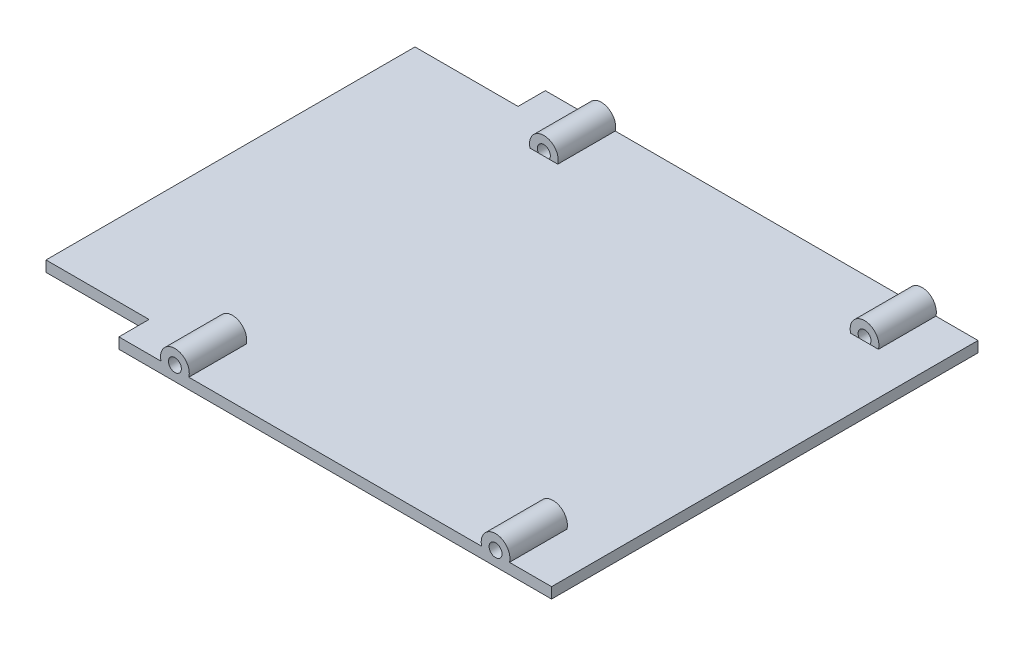
ISO-10303-21;
HEADER;
FILE_DESCRIPTION(('STEP AP214'),'2;1');
FILE_NAME('part.step','',(''),(''),'','','');
FILE_SCHEMA(('AUTOMOTIVE_DESIGN { 1 0 10303 214 1 1 1 1 }'));
ENDSEC;
DATA;
#1=APPLICATION_CONTEXT('core data for automotive mechanical design processes');
#2=APPLICATION_PROTOCOL_DEFINITION('international standard','automotive_design',2000,#1);
#3=PRODUCT_CONTEXT('',#1,'mechanical');
#4=PRODUCT('Part','Part','',(#3));
#5=PRODUCT_RELATED_PRODUCT_CATEGORY('part','',(#4));
#6=PRODUCT_DEFINITION_FORMATION('','',#4);
#7=PRODUCT_DEFINITION_CONTEXT('part definition',#1,'design');
#8=PRODUCT_DEFINITION('design','',#6,#7);
#9=PRODUCT_DEFINITION_SHAPE('','',#8);
#10=(LENGTH_UNIT() NAMED_UNIT(*) SI_UNIT(.MILLI.,.METRE.));
#11=(NAMED_UNIT(*) PLANE_ANGLE_UNIT() SI_UNIT($,.RADIAN.));
#12=(NAMED_UNIT(*) SI_UNIT($,.STERADIAN.) SOLID_ANGLE_UNIT());
#13=UNCERTAINTY_MEASURE_WITH_UNIT(LENGTH_MEASURE(1.E-05),#10,'distance_accuracy_value','');
#14=(GEOMETRIC_REPRESENTATION_CONTEXT(3) GLOBAL_UNCERTAINTY_ASSIGNED_CONTEXT((#13)) GLOBAL_UNIT_ASSIGNED_CONTEXT((#10,
#11,#12)) REPRESENTATION_CONTEXT('',''));
#15=CARTESIAN_POINT('',(0.,0.,0.));
#16=DIRECTION('',(0.,0.,1.));
#17=DIRECTION('',(1.,0.,0.));
#18=AXIS2_PLACEMENT_3D('',#15,#16,#17);
#19=CARTESIAN_POINT('',(-536.173043629544,-6.26719487503217,135.104672809914));
#20=DIRECTION('',(1.,0.,0.));
#21=DIRECTION('',(0.,0.,1.));
#22=AXIS2_PLACEMENT_3D('',#19,#20,#21);
#23=PLANE('',#22);
#24=DIRECTION('',(0.,1.,0.));
#25=VECTOR('',#24,1.);
#26=CARTESIAN_POINT('',(-536.173043629546,-26.2671948750322,19.2560035032262));
#27=LINE('',#26,#25);
#28=CARTESIAN_POINT('',(-536.173043629544,-26.2671948750323,19.2560035032263));
#29=VERTEX_POINT('',#28);
#30=CARTESIAN_POINT('',(-536.173043629544,-24.7671948750323,19.2560035032263));
#31=VERTEX_POINT('',#30);
#32=EDGE_CURVE('E573',#29,#31,#27,.T.);
#33=ORIENTED_EDGE('',*,*,#32,.T.);
#34=DIRECTION('',(0.,0.,-1.));
#35=VECTOR('',#34,1.);
#36=CARTESIAN_POINT('',(-536.173043629544,-24.7671948750323,135.104672809914));
#37=LINE('',#36,#35);
#38=CARTESIAN_POINT('',(-536.173043629544,-24.7671948750323,15.4560035032414));
#39=VERTEX_POINT('',#38);
#40=EDGE_CURVE('E521',#31,#39,#37,.T.);
#41=ORIENTED_EDGE('',*,*,#40,.T.);
#42=DIRECTION('',(0.,1.,0.));
#43=VECTOR('',#42,1.);
#44=CARTESIAN_POINT('',(-536.173043629544,-6.26719487503217,15.4560035032414));
#45=LINE('',#44,#43);
#46=CARTESIAN_POINT('',(-536.173043629544,-26.2671948750323,15.4560035032414));
#47=VERTEX_POINT('',#46);
#48=EDGE_CURVE('E539',#47,#39,#45,.T.);
#49=ORIENTED_EDGE('',*,*,#48,.F.);
#50=DIRECTION('',(0.,0.,-1.));
#51=VECTOR('',#50,1.);
#52=CARTESIAN_POINT('',(-536.173043629544,-26.2671948750323,135.104672809914));
#53=LINE('',#52,#51);
#54=EDGE_CURVE('E540',#29,#47,#53,.T.);
#55=ORIENTED_EDGE('',*,*,#54,.F.);
#56=EDGE_LOOP('',(#33,#41,#49,#55));
#57=FACE_BOUND('',#56,.T.);
#58=ADVANCED_FACE('F41',(#57),#23,.F.);
#59=DIRECTION('',(0.,-1.,0.));
#60=VECTOR('',#59,1.);
#61=CARTESIAN_POINT('',(-536.173043629546,-24.7671948750323,70.6360035032162));
#62=LINE('',#61,#60);
#63=CARTESIAN_POINT('',(-536.173043629544,-24.7671948750323,70.6360035032162));
#64=VERTEX_POINT('',#63);
#65=CARTESIAN_POINT('',(-536.173043629546,-26.2671948750323,70.6360035032162));
#66=VERTEX_POINT('',#65);
#67=EDGE_CURVE('E577',#64,#66,#62,.T.);
#68=ORIENTED_EDGE('',*,*,#67,.T.);
#69=CARTESIAN_POINT('',(-536.173043629544,-26.2671948750323,74.8360035032172));
#70=VERTEX_POINT('',#69);
#71=EDGE_CURVE('E537',#70,#66,#53,.T.);
#72=ORIENTED_EDGE('',*,*,#71,.F.);
#73=DIRECTION('',(0.,1.,0.));
#74=VECTOR('',#73,1.);
#75=CARTESIAN_POINT('',(-536.173043629544,-6.26719487503217,74.8360035032172));
#76=LINE('',#75,#74);
#77=CARTESIAN_POINT('',(-536.173043629544,-24.7671948750323,74.8360035032172));
#78=VERTEX_POINT('',#77);
#79=EDGE_CURVE('E532',#70,#78,#76,.T.);
#80=ORIENTED_EDGE('',*,*,#79,.T.);
#81=EDGE_CURVE('E517',#78,#64,#37,.T.);
#82=ORIENTED_EDGE('',*,*,#81,.T.);
#83=EDGE_LOOP('',(#68,#72,#80,#82));
#84=FACE_BOUND('',#83,.T.);
#85=ADVANCED_FACE('F256',(#84),#23,.F.);
#86=CARTESIAN_POINT('',(-360.373043629546,-24.7671948750323,135.104672809914));
#87=DIRECTION('',(0.,-1.,0.));
#88=DIRECTION('',(0.,0.,1.));
#89=AXIS2_PLACEMENT_3D('',#86,#87,#88);
#90=PLANE('',#89);
#91=DIRECTION('',(-1.,0.,0.));
#92=VECTOR('',#91,1.);
#93=CARTESIAN_POINT('',(-360.373043629546,-24.7671948750323,23.4560035032414));
#94=LINE('',#93,#92);
#95=CARTESIAN_POINT('',(-526.43655195634,-24.7671948750323,23.4560035032414));
#96=VERTEX_POINT('',#95);
#97=CARTESIAN_POINT('',(-527.624712152125,-24.7671948750322,23.4560035032414));
#98=VERTEX_POINT('',#97);
#99=EDGE_CURVE('E185',#96,#98,#94,.T.);
#100=ORIENTED_EDGE('',*,*,#99,.T.);
#101=CARTESIAN_POINT('',(-529.121375106838,-24.7671948750323,23.4560035032414));
#102=VERTEX_POINT('',#101);
#103=EDGE_CURVE('E190',#98,#102,#94,.T.);
#104=ORIENTED_EDGE('',*,*,#103,.T.);
#105=CARTESIAN_POINT('',(-530.309535302623,-24.7671948750323,23.4560035032414));
#106=VERTEX_POINT('',#105);
#107=EDGE_CURVE('E187',#102,#106,#94,.T.);
#108=ORIENTED_EDGE('',*,*,#107,.T.);
#109=DIRECTION('',(0.,0.,-1.));
#110=VECTOR('',#109,1.);
#111=CARTESIAN_POINT('',(-530.309535302623,-24.7671948750323,23.4560035032414));
#112=LINE('',#111,#110);
#113=CARTESIAN_POINT('',(-530.309535302623,-24.7671948750323,15.4560035032414));
#114=VERTEX_POINT('',#113);
#115=EDGE_CURVE('E216',#114,#106,#112,.F.);
#116=ORIENTED_EDGE('',*,*,#115,.F.);
#117=DIRECTION('',(1.,0.,0.));
#118=VECTOR('',#117,1.);
#119=CARTESIAN_POINT('',(-360.373043629546,-24.7671948750323,15.4560035032414));
#120=LINE('',#119,#118);
#121=EDGE_CURVE('E519',#39,#114,#120,.T.);
#122=ORIENTED_EDGE('',*,*,#121,.F.);
#123=ORIENTED_EDGE('',*,*,#40,.F.);
#124=DIRECTION('',(1.,0.,0.));
#125=VECTOR('',#124,1.);
#126=CARTESIAN_POINT('',(-602.124934645333,-24.7671948750274,19.2560035032262));
#127=LINE('',#126,#125);
#128=CARTESIAN_POINT('',(-550.523043629545,-24.7671948750274,19.2560035032262));
#129=VERTEX_POINT('',#128);
#130=EDGE_CURVE('E571',#129,#31,#127,.T.);
#131=ORIENTED_EDGE('',*,*,#130,.F.);
#132=DIRECTION('',(0.,0.,1.));
#133=VECTOR('',#132,1.);
#134=CARTESIAN_POINT('',(-550.523043629545,-24.7671948750312,19.2560035032262));
#135=LINE('',#134,#133);
#136=CARTESIAN_POINT('',(-550.523043629545,-24.7671948750312,70.6360035032162));
#137=VERTEX_POINT('',#136);
#138=EDGE_CURVE('E587',#129,#137,#135,.T.);
#139=ORIENTED_EDGE('',*,*,#138,.T.);
#140=DIRECTION('',(1.,0.,0.));
#141=VECTOR('',#140,1.);
#142=CARTESIAN_POINT('',(-602.124934645333,-24.7671948750274,70.6360035032162));
#143=LINE('',#142,#141);
#144=EDGE_CURVE('E581',#137,#64,#143,.T.);
#145=ORIENTED_EDGE('',*,*,#144,.T.);
#146=ORIENTED_EDGE('',*,*,#81,.F.);
#147=DIRECTION('',(1.,0.,0.));
#148=VECTOR('',#147,1.);
#149=CARTESIAN_POINT('',(-360.373043629546,-24.7671948750323,74.8360035032172));
#150=LINE('',#149,#148);
#151=CARTESIAN_POINT('',(-530.309535302028,-24.7671948750323,74.8360035032172));
#152=VERTEX_POINT('',#151);
#153=EDGE_CURVE('E618',#78,#152,#150,.T.);
#154=ORIENTED_EDGE('',*,*,#153,.T.);
#155=DIRECTION('',(0.,0.,1.));
#156=VECTOR('',#155,1.);
#157=CARTESIAN_POINT('',(-530.309535302028,-24.7671948750323,66.8360035032172));
#158=LINE('',#157,#156);
#159=CARTESIAN_POINT('',(-530.309535302028,-24.7671948750323,66.8360035032172));
#160=VERTEX_POINT('',#159);
#161=EDGE_CURVE('E559',#160,#152,#158,.T.);
#162=ORIENTED_EDGE('',*,*,#161,.F.);
#163=DIRECTION('',(1.,0.,0.));
#164=VECTOR('',#163,1.);
#165=CARTESIAN_POINT('',(-360.373043629546,-24.7671948750323,66.8360035032172));
#166=LINE('',#165,#164);
#167=CARTESIAN_POINT('',(-529.121375106838,-24.7671948750323,66.8360035032172));
#168=VERTEX_POINT('',#167);
#169=EDGE_CURVE('E568',#160,#168,#166,.T.);
#170=ORIENTED_EDGE('',*,*,#169,.T.);
#171=CARTESIAN_POINT('',(-527.624712152128,-24.7671948750323,66.8360035032172));
#172=VERTEX_POINT('',#171);
#173=EDGE_CURVE('E572',#168,#172,#166,.T.);
#174=ORIENTED_EDGE('',*,*,#173,.T.);
#175=CARTESIAN_POINT('',(-526.436551956938,-24.7671948750323,66.8360035032172));
#176=VERTEX_POINT('',#175);
#177=EDGE_CURVE('E564',#172,#176,#166,.T.);
#178=ORIENTED_EDGE('',*,*,#177,.T.);
#179=DIRECTION('',(0.,0.,1.));
#180=VECTOR('',#179,1.);
#181=CARTESIAN_POINT('',(-526.436551956938,-24.7671948750323,66.8360035032172));
#182=LINE('',#181,#180);
#183=CARTESIAN_POINT('',(-526.436551956938,-24.7671948750323,74.8360035032172));
#184=VERTEX_POINT('',#183);
#185=EDGE_CURVE('E632',#184,#176,#182,.F.);
#186=ORIENTED_EDGE('',*,*,#185,.F.);
#187=CARTESIAN_POINT('',(-485.659535303219,-24.7671948750323,74.8360035032172));
#188=VERTEX_POINT('',#187);
#189=EDGE_CURVE('E617',#184,#188,#150,.T.);
#190=ORIENTED_EDGE('',*,*,#189,.T.);
#191=DIRECTION('',(0.,0.,1.));
#192=VECTOR('',#191,1.);
#193=CARTESIAN_POINT('',(-485.659535303219,-24.7671948750323,66.8360035032172));
#194=LINE('',#193,#192);
#195=CARTESIAN_POINT('',(-485.659535303219,-24.7671948750323,66.8360035032172));
#196=VERTEX_POINT('',#195);
#197=EDGE_CURVE('E629',#196,#188,#194,.T.);
#198=ORIENTED_EDGE('',*,*,#197,.F.);
#199=DIRECTION('',(1.,0.,0.));
#200=VECTOR('',#199,1.);
#201=CARTESIAN_POINT('',(-360.373043629546,-24.7671948750323,66.8360035032172));
#202=LINE('',#201,#200);
#203=CARTESIAN_POINT('',(-484.471375106822,-24.7671948750323,66.8360035032172));
#204=VERTEX_POINT('',#203);
#205=EDGE_CURVE('E561',#196,#204,#202,.T.);
#206=ORIENTED_EDGE('',*,*,#205,.T.);
#207=CARTESIAN_POINT('',(-482.974712152113,-24.7671948750323,66.8360035032172));
#208=VERTEX_POINT('',#207);
#209=EDGE_CURVE('E558',#204,#208,#202,.T.);
#210=ORIENTED_EDGE('',*,*,#209,.T.);
#211=CARTESIAN_POINT('',(-481.786551955716,-24.7671948750323,66.8360035032172));
#212=VERTEX_POINT('',#211);
#213=EDGE_CURVE('E553',#208,#212,#202,.T.);
#214=ORIENTED_EDGE('',*,*,#213,.T.);
#215=DIRECTION('',(0.,0.,1.));
#216=VECTOR('',#215,1.);
#217=CARTESIAN_POINT('',(-481.786551955716,-24.7671948750323,66.8360035032172));
#218=LINE('',#217,#216);
#219=CARTESIAN_POINT('',(-481.786551955716,-24.7671948750323,74.8360035032172));
#220=VERTEX_POINT('',#219);
#221=EDGE_CURVE('E628',#220,#212,#218,.F.);
#222=ORIENTED_EDGE('',*,*,#221,.F.);
#223=CARTESIAN_POINT('',(-475.923043629544,-24.7671948750323,74.8360035032172));
#224=VERTEX_POINT('',#223);
#225=EDGE_CURVE('E616',#220,#224,#150,.T.);
#226=ORIENTED_EDGE('',*,*,#225,.T.);
#227=DIRECTION('',(0.,0.,-1.));
#228=VECTOR('',#227,1.);
#229=CARTESIAN_POINT('',(-475.923043629544,-24.7671948750323,135.104672809914));
#230=LINE('',#229,#228);
#231=CARTESIAN_POINT('',(-475.923043629544,-24.7671948750323,15.4560035032414));
#232=VERTEX_POINT('',#231);
#233=EDGE_CURVE('E513',#224,#232,#230,.T.);
#234=ORIENTED_EDGE('',*,*,#233,.T.);
#235=CARTESIAN_POINT('',(-481.786551956575,-24.7671948750323,15.4560035032414));
#236=VERTEX_POINT('',#235);
#237=EDGE_CURVE('E510',#236,#232,#120,.T.);
#238=ORIENTED_EDGE('',*,*,#237,.F.);
#239=DIRECTION('',(0.,0.,-1.));
#240=VECTOR('',#239,1.);
#241=CARTESIAN_POINT('',(-481.786551956575,-24.7671948750323,23.4560035032414));
#242=LINE('',#241,#240);
#243=CARTESIAN_POINT('',(-481.786551956575,-24.7671948750323,23.4560035032414));
#244=VERTEX_POINT('',#243);
#245=EDGE_CURVE('E219',#244,#236,#242,.T.);
#246=ORIENTED_EDGE('',*,*,#245,.F.);
#247=DIRECTION('',(-1.,0.,0.));
#248=VECTOR('',#247,1.);
#249=CARTESIAN_POINT('',(-360.373043629546,-24.7671948750323,23.4560035032414));
#250=LINE('',#249,#248);
#251=CARTESIAN_POINT('',(-482.974712152109,-24.7671948750323,23.4560035032414));
#252=VERTEX_POINT('',#251);
#253=EDGE_CURVE('E204',#244,#252,#250,.T.);
#254=ORIENTED_EDGE('',*,*,#253,.T.);
#255=CARTESIAN_POINT('',(-484.471375106822,-24.7671948750323,23.4560035032414));
#256=VERTEX_POINT('',#255);
#257=EDGE_CURVE('E207',#252,#256,#250,.T.);
#258=ORIENTED_EDGE('',*,*,#257,.T.);
#259=CARTESIAN_POINT('',(-485.659535302359,-24.7671948750323,23.4560035032414));
#260=VERTEX_POINT('',#259);
#261=EDGE_CURVE('E208',#256,#260,#250,.T.);
#262=ORIENTED_EDGE('',*,*,#261,.T.);
#263=DIRECTION('',(0.,0.,-1.));
#264=VECTOR('',#263,1.);
#265=CARTESIAN_POINT('',(-485.659535302359,-24.7671948750323,23.4560035032414));
#266=LINE('',#265,#264);
#267=CARTESIAN_POINT('',(-485.659535302359,-24.7671948750323,15.4560035032414));
#268=VERTEX_POINT('',#267);
#269=EDGE_CURVE('E224',#268,#260,#266,.F.);
#270=ORIENTED_EDGE('',*,*,#269,.F.);
#271=CARTESIAN_POINT('',(-526.43655195634,-24.7671948750322,15.4560035032414));
#272=VERTEX_POINT('',#271);
#273=EDGE_CURVE('E516',#272,#268,#120,.T.);
#274=ORIENTED_EDGE('',*,*,#273,.F.);
#275=DIRECTION('',(0.,0.,-1.));
#276=VECTOR('',#275,1.);
#277=CARTESIAN_POINT('',(-526.43655195634,-24.7671948750323,23.4560035032414));
#278=LINE('',#277,#276);
#279=EDGE_CURVE('E198',#96,#272,#278,.T.);
#280=ORIENTED_EDGE('',*,*,#279,.F.);
#281=EDGE_LOOP('',(#100,#104,#108,#116,#122,#123,#131,#139,#145,#146,#154,#162,#170,#174,#178,
#186,#190,#198,#206,#210,#214,#222,#226,#234,#238,#246,#254,#258,#262,#270,#274,#280));
#282=FACE_BOUND('',#281,.T.);
#283=ADVANCED_FACE('F195',(#282),#90,.F.);
#284=CARTESIAN_POINT('',(-475.923043629544,-6.26719487503217,135.104672809914));
#285=DIRECTION('',(-1.,0.,0.));
#286=DIRECTION('',(0.,0.,-1.));
#287=AXIS2_PLACEMENT_3D('',#284,#285,#286);
#288=PLANE('',#287);
#289=DIRECTION('',(0.,-1.,0.));
#290=VECTOR('',#289,1.);
#291=CARTESIAN_POINT('',(-475.923043629544,-6.26719487503217,74.8360035032172));
#292=LINE('',#291,#290);
#293=CARTESIAN_POINT('',(-475.923043629544,-26.2671948750323,74.8360035032172));
#294=VERTEX_POINT('',#293);
#295=EDGE_CURVE('E622',#224,#294,#292,.T.);
#296=ORIENTED_EDGE('',*,*,#295,.T.);
#297=DIRECTION('',(0.,0.,-1.));
#298=VECTOR('',#297,1.);
#299=CARTESIAN_POINT('',(-475.923043629544,-26.2671948750323,135.104672809914));
#300=LINE('',#299,#298);
#301=CARTESIAN_POINT('',(-475.923043629544,-26.2671948750323,15.4560035032414));
#302=VERTEX_POINT('',#301);
#303=EDGE_CURVE('E529',#294,#302,#300,.T.);
#304=ORIENTED_EDGE('',*,*,#303,.T.);
#305=DIRECTION('',(0.,-1.,0.));
#306=VECTOR('',#305,1.);
#307=CARTESIAN_POINT('',(-475.923043629544,-6.26719487503217,15.4560035032414));
#308=LINE('',#307,#306);
#309=EDGE_CURVE('E527',#232,#302,#308,.T.);
#310=ORIENTED_EDGE('',*,*,#309,.F.);
#311=ORIENTED_EDGE('',*,*,#233,.F.);
#312=EDGE_LOOP('',(#296,#304,#310,#311));
#313=FACE_BOUND('',#312,.T.);
#314=ADVANCED_FACE('F271',(#313),#288,.F.);
#315=CARTESIAN_POINT('',(-360.373043629546,-26.2671948750322,135.104672809914));
#316=DIRECTION('',(0.,1.,0.));
#317=DIRECTION('',(-1.,0.,0.));
#318=AXIS2_PLACEMENT_3D('',#315,#316,#317);
#319=PLANE('',#318);
#320=DIRECTION('',(-1.,0.,0.));
#321=VECTOR('',#320,1.);
#322=CARTESIAN_POINT('',(-360.373043629546,-26.2671948750322,15.4560035032414));
#323=LINE('',#322,#321);
#324=EDGE_CURVE('E536',#302,#47,#323,.T.);
#325=ORIENTED_EDGE('',*,*,#324,.F.);
#326=ORIENTED_EDGE('',*,*,#303,.F.);
#327=DIRECTION('',(-1.,0.,0.));
#328=VECTOR('',#327,1.);
#329=CARTESIAN_POINT('',(-360.373043629546,-26.2671948750322,74.8360035032172));
#330=LINE('',#329,#328);
#331=EDGE_CURVE('E545',#294,#70,#330,.T.);
#332=ORIENTED_EDGE('',*,*,#331,.T.);
#333=ORIENTED_EDGE('',*,*,#71,.T.);
#334=DIRECTION('',(1.,0.,0.));
#335=VECTOR('',#334,1.);
#336=CARTESIAN_POINT('',(-602.124934645333,-26.2671948750274,70.6360035032162));
#337=LINE('',#336,#335);
#338=CARTESIAN_POINT('',(-550.523043629545,-26.2671948750312,70.6360035032162));
#339=VERTEX_POINT('',#338);
#340=EDGE_CURVE('E580',#339,#66,#337,.T.);
#341=ORIENTED_EDGE('',*,*,#340,.F.);
#342=DIRECTION('',(0.,0.,-1.));
#343=VECTOR('',#342,1.);
#344=CARTESIAN_POINT('',(-550.523043629545,-26.2671948750312,70.6360035032162));
#345=LINE('',#344,#343);
#346=CARTESIAN_POINT('',(-550.523043629545,-26.2671948750312,19.2560035032262));
#347=VERTEX_POINT('',#346);
#348=EDGE_CURVE('E582',#339,#347,#345,.T.);
#349=ORIENTED_EDGE('',*,*,#348,.T.);
#350=DIRECTION('',(1.,0.,0.));
#351=VECTOR('',#350,1.);
#352=CARTESIAN_POINT('',(-602.124934645333,-26.2671948750274,19.2560035032262));
#353=LINE('',#352,#351);
#354=EDGE_CURVE('E576',#347,#29,#353,.T.);
#355=ORIENTED_EDGE('',*,*,#354,.T.);
#356=ORIENTED_EDGE('',*,*,#54,.T.);
#357=EDGE_LOOP('',(#325,#326,#332,#333,#341,#349,#355,#356));
#358=FACE_BOUND('',#357,.T.);
#359=ADVANCED_FACE('F268',(#358),#319,.F.);
#360=CARTESIAN_POINT('',(0.,0.,15.4560035032414));
#361=DIRECTION('',(0.,0.,1.));
#362=DIRECTION('',(0.,1.,0.));
#363=AXIS2_PLACEMENT_3D('',#360,#361,#362);
#364=PLANE('',#363);
#365=CARTESIAN_POINT('',(-483.723043629466,-24.267194875035,15.4560035032414));
#366=DIRECTION('',(0.,0.,1.));
#367=DIRECTION('',(1.,0.,0.));
#368=AXIS2_PLACEMENT_3D('',#365,#366,#367);
#369=CIRCLE('',#368,0.900000000000005);
#370=CARTESIAN_POINT('',(-482.823043629466,-24.267194875035,15.4560035032414));
#371=VERTEX_POINT('',#370);
#372=EDGE_CURVE('E237',#371,#371,#369,.T.);
#373=ORIENTED_EDGE('',*,*,#372,.T.);
#374=EDGE_LOOP('',(#373));
#375=FACE_BOUND('',#374,.T.);
#376=CARTESIAN_POINT('',(-528.373043629481,-24.267194875035,15.4560035032414));
#377=DIRECTION('',(0.,0.,1.));
#378=DIRECTION('',(1.,0.,0.));
#379=AXIS2_PLACEMENT_3D('',#376,#377,#378);
#380=CIRCLE('',#379,0.900000000000005);
#381=CARTESIAN_POINT('',(-527.473043629481,-24.267194875035,15.4560035032414));
#382=VERTEX_POINT('',#381);
#383=EDGE_CURVE('E179',#382,#382,#380,.T.);
#384=ORIENTED_EDGE('',*,*,#383,.T.);
#385=EDGE_LOOP('',(#384));
#386=FACE_BOUND('',#385,.T.);
#387=ORIENTED_EDGE('',*,*,#48,.T.);
#388=ORIENTED_EDGE('',*,*,#121,.T.);
#389=CARTESIAN_POINT('',(-528.373043629481,-24.267194875035,15.4560035032414));
#390=DIRECTION('',(0.,0.,1.));
#391=DIRECTION('',(1.,0.,0.));
#392=AXIS2_PLACEMENT_3D('',#389,#390,#391);
#393=CIRCLE('',#392,2.00000000003575);
#394=EDGE_CURVE('E232',#272,#114,#393,.T.);
#395=ORIENTED_EDGE('',*,*,#394,.F.);
#396=ORIENTED_EDGE('',*,*,#273,.T.);
#397=CARTESIAN_POINT('',(-483.723043629467,-24.2671948750323,15.4560035032414));
#398=DIRECTION('',(0.,0.,1.));
#399=DIRECTION('',(1.,0.,0.));
#400=AXIS2_PLACEMENT_3D('',#397,#398,#399);
#401=CIRCLE('',#400,1.99999999979497);
#402=EDGE_CURVE('E230',#236,#268,#401,.T.);
#403=ORIENTED_EDGE('',*,*,#402,.F.);
#404=ORIENTED_EDGE('',*,*,#237,.T.);
#405=ORIENTED_EDGE('',*,*,#309,.T.);
#406=ORIENTED_EDGE('',*,*,#324,.T.);
#407=EDGE_LOOP('',(#387,#388,#395,#396,#403,#404,#405,#406));
#408=FACE_BOUND('',#407,.T.);
#409=ADVANCED_FACE('F266',(#375,#386,#408),#364,.F.);
#410=CARTESIAN_POINT('',(-360.373043629544,-6.26719487503481,74.8360035032172));
#411=DIRECTION('',(0.,0.,1.));
#412=DIRECTION('',(-1.,0.,0.));
#413=AXIS2_PLACEMENT_3D('',#410,#411,#412);
#414=PLANE('',#413);
#415=CARTESIAN_POINT('',(-528.373043629483,-24.2671948750323,74.8360035032172));
#416=DIRECTION('',(0.,0.,-1.));
#417=DIRECTION('',(0.,1.,0.));
#418=AXIS2_PLACEMENT_3D('',#415,#416,#417);
#419=CIRCLE('',#418,0.900000000000005);
#420=CARTESIAN_POINT('',(-528.373043629483,-23.3671948750323,74.8360035032172));
#421=VERTEX_POINT('',#420);
#422=EDGE_CURVE('E652',#421,#421,#419,.T.);
#423=ORIENTED_EDGE('',*,*,#422,.T.);
#424=EDGE_LOOP('',(#423));
#425=FACE_BOUND('',#424,.T.);
#426=CARTESIAN_POINT('',(-483.723043629467,-24.2671948750323,74.8360035032172));
#427=DIRECTION('',(0.,0.,-1.));
#428=DIRECTION('',(0.,1.,0.));
#429=AXIS2_PLACEMENT_3D('',#426,#427,#428);
#430=CIRCLE('',#429,0.900000000000005);
#431=CARTESIAN_POINT('',(-483.723043629467,-23.3671948750323,74.8360035032172));
#432=VERTEX_POINT('',#431);
#433=EDGE_CURVE('E200',#432,#432,#430,.T.);
#434=ORIENTED_EDGE('',*,*,#433,.T.);
#435=EDGE_LOOP('',(#434));
#436=FACE_BOUND('',#435,.T.);
#437=ORIENTED_EDGE('',*,*,#153,.F.);
#438=ORIENTED_EDGE('',*,*,#79,.F.);
#439=ORIENTED_EDGE('',*,*,#331,.F.);
#440=ORIENTED_EDGE('',*,*,#295,.F.);
#441=ORIENTED_EDGE('',*,*,#225,.F.);
#442=CARTESIAN_POINT('',(-483.723043629467,-24.2671948750323,74.8360035032172));
#443=DIRECTION('',(0.,0.,-1.));
#444=DIRECTION('',(0.,1.,0.));
#445=AXIS2_PLACEMENT_3D('',#442,#443,#444);
#446=CIRCLE('',#445,2.00000000062726);
#447=EDGE_CURVE('E626',#188,#220,#446,.T.);
#448=ORIENTED_EDGE('',*,*,#447,.F.);
#449=ORIENTED_EDGE('',*,*,#189,.F.);
#450=CARTESIAN_POINT('',(-528.373043629483,-24.2671948750323,74.8360035032172));
#451=DIRECTION('',(0.,0.,-1.));
#452=DIRECTION('',(0.,1.,0.));
#453=AXIS2_PLACEMENT_3D('',#450,#451,#452);
#454=CIRCLE('',#453,1.99999999945899);
#455=EDGE_CURVE('E634',#152,#184,#454,.T.);
#456=ORIENTED_EDGE('',*,*,#455,.F.);
#457=EDGE_LOOP('',(#437,#438,#439,#440,#441,#448,#449,#456));
#458=FACE_BOUND('',#457,.T.);
#459=ADVANCED_FACE('F43',(#425,#436,#458),#414,.T.);
#460=CARTESIAN_POINT('',(-602.124934645333,-24.7671948750274,70.6360035032162));
#461=DIRECTION('',(0.,0.,-1.));
#462=DIRECTION('',(1.,0.,0.));
#463=AXIS2_PLACEMENT_3D('',#460,#461,#462);
#464=PLANE('',#463);
#465=DIRECTION('',(0.,-1.,0.));
#466=VECTOR('',#465,1.);
#467=CARTESIAN_POINT('',(-550.523043629545,-24.7671948750274,70.6360035032162));
#468=LINE('',#467,#466);
#469=EDGE_CURVE('E585',#137,#339,#468,.T.);
#470=ORIENTED_EDGE('',*,*,#469,.T.);
#471=ORIENTED_EDGE('',*,*,#340,.T.);
#472=ORIENTED_EDGE('',*,*,#67,.F.);
#473=ORIENTED_EDGE('',*,*,#144,.F.);
#474=EDGE_LOOP('',(#470,#471,#472,#473));
#475=FACE_BOUND('',#474,.T.);
#476=ADVANCED_FACE('F306',(#475),#464,.F.);
#477=CARTESIAN_POINT('',(-602.124934645333,-26.2671948750274,19.2560035032262));
#478=DIRECTION('',(0.,0.,1.));
#479=DIRECTION('',(-1.,0.,0.));
#480=AXIS2_PLACEMENT_3D('',#477,#478,#479);
#481=PLANE('',#480);
#482=DIRECTION('',(0.,1.,0.));
#483=VECTOR('',#482,1.);
#484=CARTESIAN_POINT('',(-550.523043629545,-26.2671948750274,19.2560035032262));
#485=LINE('',#484,#483);
#486=EDGE_CURVE('E575',#347,#129,#485,.T.);
#487=ORIENTED_EDGE('',*,*,#486,.T.);
#488=ORIENTED_EDGE('',*,*,#130,.T.);
#489=ORIENTED_EDGE('',*,*,#32,.F.);
#490=ORIENTED_EDGE('',*,*,#354,.F.);
#491=EDGE_LOOP('',(#487,#488,#489,#490));
#492=FACE_BOUND('',#491,.T.);
#493=ADVANCED_FACE('F314',(#492),#481,.F.);
#494=CARTESIAN_POINT('',(-550.523043629545,-23.2671948750155,-1.38331061583378));
#495=DIRECTION('',(-1.,0.,0.));
#496=DIRECTION('',(0.,0.,-1.));
#497=AXIS2_PLACEMENT_3D('',#494,#495,#496);
#498=PLANE('',#497);
#499=ORIENTED_EDGE('',*,*,#486,.F.);
#500=ORIENTED_EDGE('',*,*,#348,.F.);
#501=ORIENTED_EDGE('',*,*,#469,.F.);
#502=ORIENTED_EDGE('',*,*,#138,.F.);
#503=EDGE_LOOP('',(#499,#500,#501,#502));
#504=FACE_BOUND('',#503,.T.);
#505=ADVANCED_FACE('F323',(#504),#498,.T.);
#506=CARTESIAN_POINT('',(-483.723043629467,-24.2671948750323,66.8360035032172));
#507=DIRECTION('',(0.,0.,1.));
#508=DIRECTION('',(0.,1.,0.));
#509=AXIS2_PLACEMENT_3D('',#506,#507,#508);
#510=PLANE('',#509);
#511=ORIENTED_EDGE('',*,*,#205,.F.);
#512=CARTESIAN_POINT('',(-483.723043629467,-24.2671948750323,66.8360035032172));
#513=DIRECTION('',(0.,0.,-1.));
#514=DIRECTION('',(0.,1.,0.));
#515=AXIS2_PLACEMENT_3D('',#512,#513,#514);
#516=CIRCLE('',#515,2.00000000062726);
#517=EDGE_CURVE('E555',#196,#212,#516,.T.);
#518=ORIENTED_EDGE('',*,*,#517,.T.);
#519=ORIENTED_EDGE('',*,*,#213,.F.);
#520=CARTESIAN_POINT('',(-483.723043629467,-24.2671948750323,66.8360035032172));
#521=DIRECTION('',(0.,0.,-1.));
#522=DIRECTION('',(0.,1.,0.));
#523=AXIS2_PLACEMENT_3D('',#520,#521,#522);
#524=CIRCLE('',#523,0.900000000000005);
#525=EDGE_CURVE('E189',#204,#208,#524,.T.);
#526=ORIENTED_EDGE('',*,*,#525,.F.);
#527=EDGE_LOOP('',(#511,#518,#519,#526));
#528=FACE_BOUND('',#527,.T.);
#529=ADVANCED_FACE('F332',(#528),#510,.F.);
#530=CARTESIAN_POINT('',(-483.723043629467,-24.2671948750323,66.8360035032172));
#531=DIRECTION('',(0.,0.,1.));
#532=DIRECTION('',(0.,1.,0.));
#533=AXIS2_PLACEMENT_3D('',#530,#531,#532);
#534=CYLINDRICAL_SURFACE('',#533,2.00000000062726);
#535=ORIENTED_EDGE('',*,*,#197,.T.);
#536=ORIENTED_EDGE('',*,*,#447,.T.);
#537=ORIENTED_EDGE('',*,*,#221,.T.);
#538=ORIENTED_EDGE('',*,*,#517,.F.);
#539=EDGE_LOOP('',(#535,#536,#537,#538));
#540=FACE_BOUND('',#539,.T.);
#541=ADVANCED_FACE('F340',(#540),#534,.T.);
#542=CARTESIAN_POINT('',(-528.373043629483,-24.2671948750323,66.8360035032172));
#543=DIRECTION('',(0.,0.,1.));
#544=DIRECTION('',(0.,1.,0.));
#545=AXIS2_PLACEMENT_3D('',#542,#543,#544);
#546=PLANE('',#545);
#547=ORIENTED_EDGE('',*,*,#169,.F.);
#548=CARTESIAN_POINT('',(-528.373043629483,-24.2671948750323,66.8360035032172));
#549=DIRECTION('',(0.,0.,-1.));
#550=DIRECTION('',(0.,1.,0.));
#551=AXIS2_PLACEMENT_3D('',#548,#549,#550);
#552=CIRCLE('',#551,1.99999999945899);
#553=EDGE_CURVE('E630',#160,#176,#552,.T.);
#554=ORIENTED_EDGE('',*,*,#553,.T.);
#555=ORIENTED_EDGE('',*,*,#177,.F.);
#556=CARTESIAN_POINT('',(-528.373043629483,-24.2671948750323,66.8360035032172));
#557=DIRECTION('',(0.,0.,-1.));
#558=DIRECTION('',(0.,1.,0.));
#559=AXIS2_PLACEMENT_3D('',#556,#557,#558);
#560=CIRCLE('',#559,0.900000000000005);
#561=EDGE_CURVE('E542',#168,#172,#560,.T.);
#562=ORIENTED_EDGE('',*,*,#561,.F.);
#563=EDGE_LOOP('',(#547,#554,#555,#562));
#564=FACE_BOUND('',#563,.T.);
#565=ADVANCED_FACE('F349',(#564),#546,.F.);
#566=CARTESIAN_POINT('',(-528.373043629483,-24.2671948750323,66.8360035032172));
#567=DIRECTION('',(0.,0.,1.));
#568=DIRECTION('',(0.,1.,0.));
#569=AXIS2_PLACEMENT_3D('',#566,#567,#568);
#570=CYLINDRICAL_SURFACE('',#569,1.99999999945899);
#571=ORIENTED_EDGE('',*,*,#161,.T.);
#572=ORIENTED_EDGE('',*,*,#455,.T.);
#573=ORIENTED_EDGE('',*,*,#185,.T.);
#574=ORIENTED_EDGE('',*,*,#553,.F.);
#575=EDGE_LOOP('',(#571,#572,#573,#574));
#576=FACE_BOUND('',#575,.T.);
#577=ADVANCED_FACE('F358',(#576),#570,.T.);
#578=CARTESIAN_POINT('',(-528.373043629483,-24.2671948750323,66.8360035032172));
#579=DIRECTION('',(0.,0.,1.));
#580=DIRECTION('',(0.,1.,0.));
#581=AXIS2_PLACEMENT_3D('',#578,#579,#580);
#582=PLANE('',#581);
#583=ORIENTED_EDGE('',*,*,#173,.F.);
#584=CARTESIAN_POINT('',(-528.373043629483,-24.2671948750323,66.8360035032172));
#585=DIRECTION('',(0.,0.,-1.));
#586=DIRECTION('',(0.,1.,0.));
#587=AXIS2_PLACEMENT_3D('',#584,#585,#586);
#588=CIRCLE('',#587,0.900000000000005);
#589=EDGE_CURVE('E647',#172,#168,#588,.T.);
#590=ORIENTED_EDGE('',*,*,#589,.F.);
#591=EDGE_LOOP('',(#583,#590));
#592=FACE_BOUND('',#591,.T.);
#593=ADVANCED_FACE('F367',(#592),#582,.T.);
#594=CARTESIAN_POINT('',(-528.373043629483,-24.2671948750323,66.8360035032172));
#595=DIRECTION('',(0.,0.,1.));
#596=DIRECTION('',(0.,1.,0.));
#597=AXIS2_PLACEMENT_3D('',#594,#595,#596);
#598=CYLINDRICAL_SURFACE('',#597,0.900000000000005);
#599=ORIENTED_EDGE('',*,*,#589,.T.);
#600=ORIENTED_EDGE('',*,*,#561,.T.);
#601=EDGE_LOOP('',(#599,#600));
#602=FACE_BOUND('',#601,.T.);
#603=ORIENTED_EDGE('',*,*,#422,.F.);
#604=EDGE_LOOP('',(#603));
#605=FACE_BOUND('',#604,.T.);
#606=ADVANCED_FACE('F376',(#602,#605),#598,.F.);
#607=CARTESIAN_POINT('',(-483.723043629467,-24.2671948750323,66.8360035032172));
#608=DIRECTION('',(0.,0.,1.));
#609=DIRECTION('',(0.,1.,0.));
#610=AXIS2_PLACEMENT_3D('',#607,#608,#609);
#611=PLANE('',#610);
#612=ORIENTED_EDGE('',*,*,#209,.F.);
#613=CARTESIAN_POINT('',(-483.723043629467,-24.2671948750323,66.8360035032172));
#614=DIRECTION('',(0.,0.,-1.));
#615=DIRECTION('',(0.,1.,0.));
#616=AXIS2_PLACEMENT_3D('',#613,#614,#615);
#617=CIRCLE('',#616,0.900000000000005);
#618=EDGE_CURVE('E199',#208,#204,#617,.T.);
#619=ORIENTED_EDGE('',*,*,#618,.F.);
#620=EDGE_LOOP('',(#612,#619));
#621=FACE_BOUND('',#620,.T.);
#622=ADVANCED_FACE('F385',(#621),#611,.T.);
#623=CARTESIAN_POINT('',(-483.723043629467,-24.2671948750323,66.8360035032172));
#624=DIRECTION('',(0.,0.,1.));
#625=DIRECTION('',(0.,1.,0.));
#626=AXIS2_PLACEMENT_3D('',#623,#624,#625);
#627=CYLINDRICAL_SURFACE('',#626,0.900000000000005);
#628=ORIENTED_EDGE('',*,*,#618,.T.);
#629=ORIENTED_EDGE('',*,*,#525,.T.);
#630=EDGE_LOOP('',(#628,#629));
#631=FACE_BOUND('',#630,.T.);
#632=ORIENTED_EDGE('',*,*,#433,.F.);
#633=EDGE_LOOP('',(#632));
#634=FACE_BOUND('',#633,.T.);
#635=ADVANCED_FACE('F394',(#631,#634),#627,.F.);
#636=CARTESIAN_POINT('',(-483.723043629467,-24.2671948750323,23.4560035032414));
#637=DIRECTION('',(0.,0.,-1.));
#638=DIRECTION('',(1.,0.,0.));
#639=AXIS2_PLACEMENT_3D('',#636,#637,#638);
#640=PLANE('',#639);
#641=ORIENTED_EDGE('',*,*,#253,.F.);
#642=CARTESIAN_POINT('',(-483.723043629467,-24.2671948750323,23.4560035032414));
#643=DIRECTION('',(0.,0.,1.));
#644=DIRECTION('',(1.,0.,0.));
#645=AXIS2_PLACEMENT_3D('',#642,#643,#644);
#646=CIRCLE('',#645,1.99999999979497);
#647=EDGE_CURVE('E228',#244,#260,#646,.T.);
#648=ORIENTED_EDGE('',*,*,#647,.T.);
#649=ORIENTED_EDGE('',*,*,#261,.F.);
#650=CARTESIAN_POINT('',(-483.723043629466,-24.267194875035,23.4560035032414));
#651=DIRECTION('',(0.,0.,1.));
#652=DIRECTION('',(1.,0.,0.));
#653=AXIS2_PLACEMENT_3D('',#650,#651,#652);
#654=CIRCLE('',#653,0.900000000000005);
#655=EDGE_CURVE('E11',#252,#256,#654,.T.);
#656=ORIENTED_EDGE('',*,*,#655,.F.);
#657=EDGE_LOOP('',(#641,#648,#649,#656));
#658=FACE_BOUND('',#657,.T.);
#659=ADVANCED_FACE('F245',(#658),#640,.F.);
#660=CARTESIAN_POINT('',(-483.723043629467,-24.2671948750323,23.4560035032414));
#661=DIRECTION('',(0.,0.,-1.));
#662=DIRECTION('',(1.,0.,0.));
#663=AXIS2_PLACEMENT_3D('',#660,#661,#662);
#664=CYLINDRICAL_SURFACE('',#663,1.99999999979497);
#665=ORIENTED_EDGE('',*,*,#245,.T.);
#666=ORIENTED_EDGE('',*,*,#402,.T.);
#667=ORIENTED_EDGE('',*,*,#269,.T.);
#668=ORIENTED_EDGE('',*,*,#647,.F.);
#669=EDGE_LOOP('',(#665,#666,#667,#668));
#670=FACE_BOUND('',#669,.T.);
#671=ADVANCED_FACE('F411',(#670),#664,.T.);
#672=CARTESIAN_POINT('',(-528.373043629481,-24.267194875035,23.4560035032414));
#673=DIRECTION('',(0.,0.,-1.));
#674=DIRECTION('',(1.,0.,0.));
#675=AXIS2_PLACEMENT_3D('',#672,#673,#674);
#676=PLANE('',#675);
#677=ORIENTED_EDGE('',*,*,#99,.F.);
#678=CARTESIAN_POINT('',(-528.373043629481,-24.267194875035,23.4560035032414));
#679=DIRECTION('',(0.,0.,1.));
#680=DIRECTION('',(1.,0.,0.));
#681=AXIS2_PLACEMENT_3D('',#678,#679,#680);
#682=CIRCLE('',#681,2.00000000003575);
#683=EDGE_CURVE('E227',#96,#106,#682,.T.);
#684=ORIENTED_EDGE('',*,*,#683,.T.);
#685=ORIENTED_EDGE('',*,*,#107,.F.);
#686=CARTESIAN_POINT('',(-528.373043629481,-24.267194875035,23.4560035032414));
#687=DIRECTION('',(0.,0.,1.));
#688=DIRECTION('',(1.,0.,0.));
#689=AXIS2_PLACEMENT_3D('',#686,#687,#688);
#690=CIRCLE('',#689,0.900000000000005);
#691=EDGE_CURVE('E49',#98,#102,#690,.T.);
#692=ORIENTED_EDGE('',*,*,#691,.F.);
#693=EDGE_LOOP('',(#677,#684,#685,#692));
#694=FACE_BOUND('',#693,.T.);
#695=ADVANCED_FACE('F183',(#694),#676,.F.);
#696=CARTESIAN_POINT('',(-528.373043629481,-24.267194875035,23.4560035032414));
#697=DIRECTION('',(0.,0.,-1.));
#698=DIRECTION('',(1.,0.,0.));
#699=AXIS2_PLACEMENT_3D('',#696,#697,#698);
#700=CYLINDRICAL_SURFACE('',#699,2.00000000003575);
#701=ORIENTED_EDGE('',*,*,#279,.T.);
#702=ORIENTED_EDGE('',*,*,#394,.T.);
#703=ORIENTED_EDGE('',*,*,#115,.T.);
#704=ORIENTED_EDGE('',*,*,#683,.F.);
#705=EDGE_LOOP('',(#701,#702,#703,#704));
#706=FACE_BOUND('',#705,.T.);
#707=ADVANCED_FACE('F427',(#706),#700,.T.);
#708=CARTESIAN_POINT('',(-528.373043629481,-24.267194875035,23.4560035032414));
#709=DIRECTION('',(0.,0.,-1.));
#710=DIRECTION('',(1.,0.,0.));
#711=AXIS2_PLACEMENT_3D('',#708,#709,#710);
#712=PLANE('',#711);
#713=ORIENTED_EDGE('',*,*,#103,.F.);
#714=CARTESIAN_POINT('',(-528.373043629481,-24.267194875035,23.4560035032414));
#715=DIRECTION('',(0.,0.,1.));
#716=DIRECTION('',(1.,0.,0.));
#717=AXIS2_PLACEMENT_3D('',#714,#715,#716);
#718=CIRCLE('',#717,0.900000000000005);
#719=EDGE_CURVE('E61',#102,#98,#718,.T.);
#720=ORIENTED_EDGE('',*,*,#719,.F.);
#721=EDGE_LOOP('',(#713,#720));
#722=FACE_BOUND('',#721,.T.);
#723=ADVANCED_FACE('F191',(#722),#712,.T.);
#724=CARTESIAN_POINT('',(-528.373043629481,-24.267194875035,23.4560035032414));
#725=DIRECTION('',(0.,0.,-1.));
#726=DIRECTION('',(1.,0.,0.));
#727=AXIS2_PLACEMENT_3D('',#724,#725,#726);
#728=CYLINDRICAL_SURFACE('',#727,0.900000000000005);
#729=ORIENTED_EDGE('',*,*,#719,.T.);
#730=ORIENTED_EDGE('',*,*,#691,.T.);
#731=EDGE_LOOP('',(#729,#730));
#732=FACE_BOUND('',#731,.T.);
#733=ORIENTED_EDGE('',*,*,#383,.F.);
#734=EDGE_LOOP('',(#733));
#735=FACE_BOUND('',#734,.T.);
#736=ADVANCED_FACE('F176',(#732,#735),#728,.F.);
#737=CARTESIAN_POINT('',(-483.723043629466,-24.267194875035,23.4560035032414));
#738=DIRECTION('',(0.,0.,-1.));
#739=DIRECTION('',(1.,0.,0.));
#740=AXIS2_PLACEMENT_3D('',#737,#738,#739);
#741=PLANE('',#740);
#742=ORIENTED_EDGE('',*,*,#257,.F.);
#743=CARTESIAN_POINT('',(-483.723043629466,-24.267194875035,23.4560035032414));
#744=DIRECTION('',(0.,0.,1.));
#745=DIRECTION('',(1.,0.,0.));
#746=AXIS2_PLACEMENT_3D('',#743,#744,#745);
#747=CIRCLE('',#746,0.900000000000005);
#748=EDGE_CURVE('E55',#256,#252,#747,.T.);
#749=ORIENTED_EDGE('',*,*,#748,.F.);
#750=EDGE_LOOP('',(#742,#749));
#751=FACE_BOUND('',#750,.T.);
#752=ADVANCED_FACE('F246',(#751),#741,.T.);
#753=CARTESIAN_POINT('',(-483.723043629466,-24.267194875035,23.4560035032414));
#754=DIRECTION('',(0.,0.,-1.));
#755=DIRECTION('',(1.,0.,0.));
#756=AXIS2_PLACEMENT_3D('',#753,#754,#755);
#757=CYLINDRICAL_SURFACE('',#756,0.900000000000005);
#758=ORIENTED_EDGE('',*,*,#748,.T.);
#759=ORIENTED_EDGE('',*,*,#655,.T.);
#760=EDGE_LOOP('',(#758,#759));
#761=FACE_BOUND('',#760,.T.);
#762=ORIENTED_EDGE('',*,*,#372,.F.);
#763=EDGE_LOOP('',(#762));
#764=FACE_BOUND('',#763,.T.);
#765=ADVANCED_FACE('F242',(#761,#764),#757,.F.);
#766=CLOSED_SHELL('',(#58,#85,#283,#314,#359,#409,#459,#476,#493,#505,#529,#541,#565,#577,#593,
#606,#622,#635,#659,#671,#695,#707,#723,#736,#752,#765));
#767=MANIFOLD_SOLID_BREP('B2',#766);
#768=ADVANCED_BREP_SHAPE_REPRESENTATION('',(#18,#767),#14);
#769=SHAPE_DEFINITION_REPRESENTATION(#9,#768);
ENDSEC;
END-ISO-10303-21;
